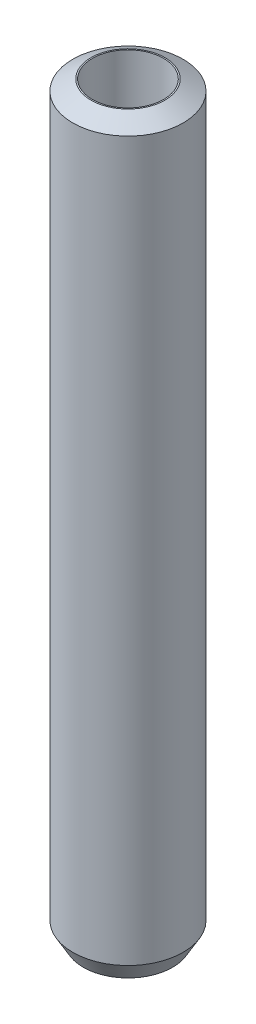
ISO-10303-21;
HEADER;
FILE_DESCRIPTION(('STEP AP214'),'2;1');
FILE_NAME('part.step','',(''),(''),'','','');
FILE_SCHEMA(('AUTOMOTIVE_DESIGN { 1 0 10303 214 1 1 1 1 }'));
ENDSEC;
DATA;
#1=APPLICATION_CONTEXT('core data for automotive mechanical design processes');
#2=APPLICATION_PROTOCOL_DEFINITION('international standard','automotive_design',2000,#1);
#3=PRODUCT_CONTEXT('',#1,'mechanical');
#4=PRODUCT('Part','Part','',(#3));
#5=PRODUCT_RELATED_PRODUCT_CATEGORY('part','',(#4));
#6=PRODUCT_DEFINITION_FORMATION('','',#4);
#7=PRODUCT_DEFINITION_CONTEXT('part definition',#1,'design');
#8=PRODUCT_DEFINITION('design','',#6,#7);
#9=PRODUCT_DEFINITION_SHAPE('','',#8);
#10=(LENGTH_UNIT() NAMED_UNIT(*) SI_UNIT(.MILLI.,.METRE.));
#11=(NAMED_UNIT(*) PLANE_ANGLE_UNIT() SI_UNIT($,.RADIAN.));
#12=(NAMED_UNIT(*) SI_UNIT($,.STERADIAN.) SOLID_ANGLE_UNIT());
#13=UNCERTAINTY_MEASURE_WITH_UNIT(LENGTH_MEASURE(1.E-05),#10,'distance_accuracy_value','');
#14=(GEOMETRIC_REPRESENTATION_CONTEXT(3) GLOBAL_UNCERTAINTY_ASSIGNED_CONTEXT((#13)) GLOBAL_UNIT_ASSIGNED_CONTEXT((#10,
#11,#12)) REPRESENTATION_CONTEXT('',''));
#15=CARTESIAN_POINT('',(0.,0.,0.));
#16=DIRECTION('',(0.,0.,1.));
#17=DIRECTION('',(1.,0.,0.));
#18=AXIS2_PLACEMENT_3D('',#15,#16,#17);
#19=CARTESIAN_POINT('',(0.,304.49320759124,0.));
#20=DIRECTION('',(0.,-1.,0.));
#21=DIRECTION('',(0.,0.,-1.));
#22=AXIS2_PLACEMENT_3D('',#19,#20,#21);
#23=CYLINDRICAL_SURFACE('',#22,22.5);
#24=CARTESIAN_POINT('',(0.,300.198880004159,0.));
#25=DIRECTION('',(0.,1.,0.));
#26=DIRECTION('',(0.,0.,1.));
#27=AXIS2_PLACEMENT_3D('',#24,#25,#26);
#28=CIRCLE('',#27,22.5);
#29=CARTESIAN_POINT('',(0.,300.198880004159,22.5));
#30=VERTEX_POINT('',#29);
#31=EDGE_CURVE('E50',#30,#30,#28,.F.);
#32=ORIENTED_EDGE('',*,*,#31,.T.);
#33=EDGE_LOOP('',(#32));
#34=FACE_BOUND('',#33,.T.);
#35=CARTESIAN_POINT('',(0.,7.43799356516867,0.));
#36=DIRECTION('',(0.,1.,0.));
#37=DIRECTION('',(0.,0.,1.));
#38=AXIS2_PLACEMENT_3D('',#35,#36,#37);
#39=CIRCLE('',#38,22.5);
#40=CARTESIAN_POINT('',(0.,7.43799356516867,22.5));
#41=VERTEX_POINT('',#40);
#42=EDGE_CURVE('E51',#41,#41,#39,.T.);
#43=ORIENTED_EDGE('',*,*,#42,.T.);
#44=EDGE_LOOP('',(#43));
#45=FACE_BOUND('',#44,.T.);
#46=ADVANCED_FACE('F39',(#34,#45),#23,.T.);
#47=CARTESIAN_POINT('',(0.,304.49320759124,0.));
#48=DIRECTION('',(0.,1.,0.));
#49=DIRECTION('',(0.,0.,1.));
#50=AXIS2_PLACEMENT_3D('',#47,#48,#49);
#51=PLANE('',#50);
#52=CARTESIAN_POINT('',(0.,304.49320759124,0.));
#53=DIRECTION('',(0.,1.,0.));
#54=DIRECTION('',(0.,0.,1.));
#55=AXIS2_PLACEMENT_3D('',#52,#53,#54);
#56=CIRCLE('',#55,15.0620064348312);
#57=CARTESIAN_POINT('',(0.,304.49320759124,15.0620064348312));
#58=VERTEX_POINT('',#57);
#59=EDGE_CURVE('E54',#58,#58,#56,.T.);
#60=ORIENTED_EDGE('',*,*,#59,.T.);
#61=EDGE_LOOP('',(#60));
#62=FACE_BOUND('',#61,.T.);
#63=CARTESIAN_POINT('',(0.,304.49320759124,0.));
#64=DIRECTION('',(0.,1.,0.));
#65=DIRECTION('',(0.,0.,1.));
#66=AXIS2_PLACEMENT_3D('',#63,#64,#65);
#67=CIRCLE('',#66,14.5182056150086);
#68=CARTESIAN_POINT('',(0.,304.49320759124,14.5182056150086));
#69=VERTEX_POINT('',#68);
#70=EDGE_CURVE('E58',#69,#69,#67,.T.);
#71=ORIENTED_EDGE('',*,*,#70,.F.);
#72=EDGE_LOOP('',(#71));
#73=FACE_BOUND('',#72,.T.);
#74=ADVANCED_FACE('F69',(#62,#73),#51,.T.);
#75=CARTESIAN_POINT('',(0.,0.,0.));
#76=DIRECTION('',(0.,1.,0.));
#77=DIRECTION('',(0.,0.,1.));
#78=AXIS2_PLACEMENT_3D('',#75,#76,#77);
#79=PLANE('',#78);
#80=CARTESIAN_POINT('',(0.,0.,0.));
#81=DIRECTION('',(0.,1.,0.));
#82=DIRECTION('',(0.,0.,1.));
#83=AXIS2_PLACEMENT_3D('',#80,#81,#82);
#84=CIRCLE('',#83,18.2056724129191);
#85=CARTESIAN_POINT('',(0.,0.,18.2056724129191));
#86=VERTEX_POINT('',#85);
#87=EDGE_CURVE('E10',#86,#86,#84,.F.);
#88=ORIENTED_EDGE('',*,*,#87,.T.);
#89=EDGE_LOOP('',(#88));
#90=FACE_BOUND('',#89,.T.);
#91=CARTESIAN_POINT('',(0.,0.,0.));
#92=DIRECTION('',(0.,1.,0.));
#93=DIRECTION('',(0.,0.,1.));
#94=AXIS2_PLACEMENT_3D('',#91,#92,#93);
#95=CIRCLE('',#94,14.5182056150086);
#96=CARTESIAN_POINT('',(0.,0.,14.5182056150086));
#97=VERTEX_POINT('',#96);
#98=EDGE_CURVE('E63',#97,#97,#95,.T.);
#99=ORIENTED_EDGE('',*,*,#98,.T.);
#100=EDGE_LOOP('',(#99));
#101=FACE_BOUND('',#100,.T.);
#102=ADVANCED_FACE('F75',(#90,#101),#79,.F.);
#103=CARTESIAN_POINT('',(0.,304.49320759124,0.));
#104=DIRECTION('',(0.,-1.,0.));
#105=DIRECTION('',(0.,0.,-1.));
#106=AXIS2_PLACEMENT_3D('',#103,#104,#105);
#107=CYLINDRICAL_SURFACE('',#106,14.5182056150086);
#108=ORIENTED_EDGE('',*,*,#70,.T.);
#109=EDGE_LOOP('',(#108));
#110=FACE_BOUND('',#109,.T.);
#111=ORIENTED_EDGE('',*,*,#98,.F.);
#112=EDGE_LOOP('',(#111));
#113=FACE_BOUND('',#112,.T.);
#114=ADVANCED_FACE('F70',(#110,#113),#107,.F.);
#115=CARTESIAN_POINT('',(0.,304.49320759124,0.));
#116=DIRECTION('',(0.,-1.,0.));
#117=DIRECTION('',(0.,0.,-1.));
#118=AXIS2_PLACEMENT_3D('',#115,#116,#117);
#119=CONICAL_SURFACE('',#118,15.0620064348312,1.04719755119659);
#120=ORIENTED_EDGE('',*,*,#31,.F.);
#121=EDGE_LOOP('',(#120));
#122=FACE_BOUND('',#121,.T.);
#123=ORIENTED_EDGE('',*,*,#59,.F.);
#124=EDGE_LOOP('',(#123));
#125=FACE_BOUND('',#124,.T.);
#126=ADVANCED_FACE('F81',(#122,#125),#119,.T.);
#127=CARTESIAN_POINT('',(0.,7.43799356516867,0.));
#128=DIRECTION('',(0.,1.,0.));
#129=DIRECTION('',(0.,0.,1.));
#130=AXIS2_PLACEMENT_3D('',#127,#128,#129);
#131=CONICAL_SURFACE('',#130,22.5,0.523598775598304);
#132=ORIENTED_EDGE('',*,*,#87,.F.);
#133=EDGE_LOOP('',(#132));
#134=FACE_BOUND('',#133,.T.);
#135=ORIENTED_EDGE('',*,*,#42,.F.);
#136=EDGE_LOOP('',(#135));
#137=FACE_BOUND('',#136,.T.);
#138=ADVANCED_FACE('F45',(#134,#137),#131,.T.);
#139=CLOSED_SHELL('',(#46,#74,#102,#114,#126,#138));
#140=MANIFOLD_SOLID_BREP('B2',#139);
#141=ADVANCED_BREP_SHAPE_REPRESENTATION('',(#18,#140),#14);
#142=SHAPE_DEFINITION_REPRESENTATION(#9,#141);
ENDSEC;
END-ISO-10303-21;
